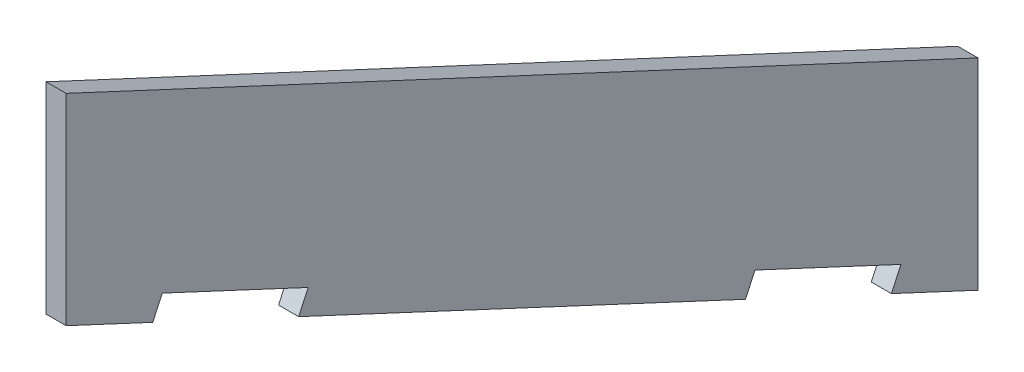
ISO-10303-21;
HEADER;
FILE_DESCRIPTION(('STEP AP214'),'2;1');
FILE_NAME('part.step','',(''),(''),'','','');
FILE_SCHEMA(('AUTOMOTIVE_DESIGN { 1 0 10303 214 1 1 1 1 }'));
ENDSEC;
DATA;
#1=APPLICATION_CONTEXT('core data for automotive mechanical design processes');
#2=APPLICATION_PROTOCOL_DEFINITION('international standard','automotive_design',2000,#1);
#3=PRODUCT_CONTEXT('',#1,'mechanical');
#4=PRODUCT('Part','Part','',(#3));
#5=PRODUCT_RELATED_PRODUCT_CATEGORY('part','',(#4));
#6=PRODUCT_DEFINITION_FORMATION('','',#4);
#7=PRODUCT_DEFINITION_CONTEXT('part definition',#1,'design');
#8=PRODUCT_DEFINITION('design','',#6,#7);
#9=PRODUCT_DEFINITION_SHAPE('','',#8);
#10=(LENGTH_UNIT() NAMED_UNIT(*) SI_UNIT(.MILLI.,.METRE.));
#11=(NAMED_UNIT(*) PLANE_ANGLE_UNIT() SI_UNIT($,.RADIAN.));
#12=(NAMED_UNIT(*) SI_UNIT($,.STERADIAN.) SOLID_ANGLE_UNIT());
#13=UNCERTAINTY_MEASURE_WITH_UNIT(LENGTH_MEASURE(1.E-05),#10,'distance_accuracy_value','');
#14=(GEOMETRIC_REPRESENTATION_CONTEXT(3) GLOBAL_UNCERTAINTY_ASSIGNED_CONTEXT((#13)) GLOBAL_UNIT_ASSIGNED_CONTEXT((#10,
#11,#12)) REPRESENTATION_CONTEXT('',''));
#15=CARTESIAN_POINT('',(0.,0.,0.));
#16=DIRECTION('',(0.,0.,1.));
#17=DIRECTION('',(1.,0.,0.));
#18=AXIS2_PLACEMENT_3D('',#15,#16,#17);
#19=CARTESIAN_POINT('',(34.,-2.,-10.));
#20=DIRECTION('',(0.,0.90630778703665,-0.4226182617407));
#21=DIRECTION('',(0.,-0.4226182617407,-0.906307787036649));
#22=AXIS2_PLACEMENT_3D('',#19,#20,#21);
#23=PLANE('',#22);
#24=DIRECTION('',(1.,0.,0.));
#25=VECTOR('',#24,1.);
#26=CARTESIAN_POINT('',(34.,-12.7767656743879,-33.1108485694346));
#27=LINE('',#26,#25);
#28=CARTESIAN_POINT('',(32.,-12.7767656743879,-33.1108485694346));
#29=VERTEX_POINT('',#28);
#30=CARTESIAN_POINT('',(34.,-12.7767656743879,-33.1108485694346));
#31=VERTEX_POINT('',#30);
#32=EDGE_CURVE('E11',#29,#31,#27,.T.);
#33=ORIENTED_EDGE('',*,*,#32,.F.);
#34=DIRECTION('',(0.,-0.4226182617407,-0.906307787036649));
#35=VECTOR('',#34,1.);
#36=CARTESIAN_POINT('',(32.,-2.,-10.));
#37=LINE('',#36,#35);
#38=CARTESIAN_POINT('',(32.,-33.4850604996822,-77.5199301342304));
#39=VERTEX_POINT('',#38);
#40=EDGE_CURVE('E116',#29,#39,#37,.T.);
#41=ORIENTED_EDGE('',*,*,#40,.T.);
#42=DIRECTION('',(1.,0.,0.));
#43=VECTOR('',#42,1.);
#44=CARTESIAN_POINT('',(34.,-33.4850604996822,-77.5199301342304));
#45=LINE('',#44,#43);
#46=CARTESIAN_POINT('',(34.,-33.4850604996822,-77.5199301342304));
#47=VERTEX_POINT('',#46);
#48=EDGE_CURVE('E47',#39,#47,#45,.T.);
#49=ORIENTED_EDGE('',*,*,#48,.T.);
#50=DIRECTION('',(0.,-0.4226182617407,-0.906307787036649));
#51=VECTOR('',#50,1.);
#52=CARTESIAN_POINT('',(34.,-2.,-10.));
#53=LINE('',#52,#51);
#54=EDGE_CURVE('E178',#31,#47,#53,.T.);
#55=ORIENTED_EDGE('',*,*,#54,.F.);
#56=EDGE_LOOP('',(#33,#41,#49,#55));
#57=FACE_BOUND('',#56,.T.);
#58=ADVANCED_FACE('F37',(#57),#23,.F.);
#59=CARTESIAN_POINT('',(34.,-33.7116374464413,-77.4142755687952));
#60=DIRECTION('',(0.,-0.422618261740708,-0.906307787036646));
#61=DIRECTION('',(0.,-0.906307787036646,0.422618261740708));
#62=AXIS2_PLACEMENT_3D('',#59,#60,#61);
#63=PLANE('',#62);
#64=ORIENTED_EDGE('',*,*,#48,.F.);
#65=DIRECTION('',(0.,-0.906307787036646,0.422618261740708));
#66=VECTOR('',#65,1.);
#67=CARTESIAN_POINT('',(32.,-33.7116374464413,-77.4142755687952));
#68=LINE('',#67,#66);
#69=CARTESIAN_POINT('',(32.,-31.4458679788497,-78.470821223147));
#70=VERTEX_POINT('',#69);
#71=EDGE_CURVE('E147',#70,#39,#68,.T.);
#72=ORIENTED_EDGE('',*,*,#71,.F.);
#73=DIRECTION('',(1.,0.,0.));
#74=VECTOR('',#73,1.);
#75=CARTESIAN_POINT('',(34.,-31.4458679788497,-78.470821223147));
#76=LINE('',#75,#74);
#77=CARTESIAN_POINT('',(34.,-31.4458679788497,-78.470821223147));
#78=VERTEX_POINT('',#77);
#79=EDGE_CURVE('E171',#70,#78,#76,.T.);
#80=ORIENTED_EDGE('',*,*,#79,.T.);
#81=DIRECTION('',(0.,-0.906307787036646,0.422618261740708));
#82=VECTOR('',#81,1.);
#83=CARTESIAN_POINT('',(34.,-33.7116374464413,-77.4142755687952));
#84=LINE('',#83,#82);
#85=EDGE_CURVE('E188',#78,#47,#84,.T.);
#86=ORIENTED_EDGE('',*,*,#85,.T.);
#87=EDGE_LOOP('',(#64,#72,#80,#86));
#88=FACE_BOUND('',#87,.T.);
#89=ADVANCED_FACE('F193',(#88),#63,.T.);
#90=CARTESIAN_POINT('',(34.,-31.4458679788497,-78.470821223147));
#91=DIRECTION('',(0.,-0.90630778703665,0.4226182617407));
#92=DIRECTION('',(0.,0.4226182617407,0.90630778703665));
#93=AXIS2_PLACEMENT_3D('',#90,#91,#92);
#94=PLANE('',#93);
#95=ORIENTED_EDGE('',*,*,#79,.F.);
#96=DIRECTION('',(0.,0.4226182617407,0.90630778703665));
#97=VECTOR('',#96,1.);
#98=CARTESIAN_POINT('',(32.,-31.4458679788497,-78.470821223147));
#99=LINE('',#98,#97);
#100=CARTESIAN_POINT('',(32.,-38.2077601667009,-92.9717458157334));
#101=VERTEX_POINT('',#100);
#102=EDGE_CURVE('E144',#101,#70,#99,.T.);
#103=ORIENTED_EDGE('',*,*,#102,.F.);
#104=DIRECTION('',(1.,0.,0.));
#105=VECTOR('',#104,1.);
#106=CARTESIAN_POINT('',(34.,-38.2077601667009,-92.9717458157334));
#107=LINE('',#106,#105);
#108=CARTESIAN_POINT('',(34.,-38.2077601667009,-92.9717458157334));
#109=VERTEX_POINT('',#108);
#110=EDGE_CURVE('E168',#101,#109,#107,.T.);
#111=ORIENTED_EDGE('',*,*,#110,.T.);
#112=DIRECTION('',(0.,0.4226182617407,0.90630778703665));
#113=VECTOR('',#112,1.);
#114=CARTESIAN_POINT('',(34.,-31.4458679788497,-78.470821223147));
#115=LINE('',#114,#113);
#116=EDGE_CURVE('E194',#109,#78,#115,.T.);
#117=ORIENTED_EDGE('',*,*,#116,.T.);
#118=EDGE_LOOP('',(#95,#103,#111,#117));
#119=FACE_BOUND('',#118,.T.);
#120=ADVANCED_FACE('F245',(#119),#94,.T.);
#121=CARTESIAN_POINT('',(34.,-38.2077601667009,-92.9717458157334));
#122=DIRECTION('',(0.,0.422618261740708,0.906307787036646));
#123=DIRECTION('',(0.,0.906307787036646,-0.422618261740708));
#124=AXIS2_PLACEMENT_3D('',#121,#122,#123);
#125=PLANE('',#124);
#126=ORIENTED_EDGE('',*,*,#110,.F.);
#127=DIRECTION('',(0.,0.906307787036646,-0.422618261740708));
#128=VECTOR('',#127,1.);
#129=CARTESIAN_POINT('',(32.,-38.2077601667009,-92.9717458157334));
#130=LINE('',#129,#128);
#131=CARTESIAN_POINT('',(32.,-40.2469526875334,-92.0208547268168));
#132=VERTEX_POINT('',#131);
#133=EDGE_CURVE('E141',#132,#101,#130,.T.);
#134=ORIENTED_EDGE('',*,*,#133,.F.);
#135=DIRECTION('',(1.,0.,0.));
#136=VECTOR('',#135,1.);
#137=CARTESIAN_POINT('',(34.,-40.2469526875334,-92.0208547268168));
#138=LINE('',#137,#136);
#139=CARTESIAN_POINT('',(34.,-40.2469526875334,-92.0208547268168));
#140=VERTEX_POINT('',#139);
#141=EDGE_CURVE('E165',#132,#140,#138,.T.);
#142=ORIENTED_EDGE('',*,*,#141,.T.);
#143=DIRECTION('',(0.,0.906307787036646,-0.422618261740708));
#144=VECTOR('',#143,1.);
#145=CARTESIAN_POINT('',(34.,-38.2077601667009,-92.9717458157334));
#146=LINE('',#145,#144);
#147=EDGE_CURVE('E196',#140,#109,#146,.T.);
#148=ORIENTED_EDGE('',*,*,#147,.T.);
#149=EDGE_LOOP('',(#126,#134,#142,#148));
#150=FACE_BOUND('',#149,.T.);
#151=ADVANCED_FACE('F248',(#150),#125,.T.);
#152=ORIENTED_EDGE('',*,*,#141,.F.);
#153=DIRECTION('',(0.,-0.4226182617407,-0.906307787036649));
#154=VECTOR('',#153,1.);
#155=CARTESIAN_POINT('',(32.,-2.,-10.));
#156=LINE('',#155,#154);
#157=CARTESIAN_POINT('',(32.,-44.26182617407,-100.630778703665));
#158=VERTEX_POINT('',#157);
#159=EDGE_CURVE('E138',#132,#158,#156,.T.);
#160=ORIENTED_EDGE('',*,*,#159,.T.);
#161=DIRECTION('',(1.,0.,0.));
#162=VECTOR('',#161,1.);
#163=CARTESIAN_POINT('',(34.,-44.26182617407,-100.630778703665));
#164=LINE('',#163,#162);
#165=CARTESIAN_POINT('',(34.,-44.26182617407,-100.630778703665));
#166=VERTEX_POINT('',#165);
#167=EDGE_CURVE('E162',#158,#166,#164,.T.);
#168=ORIENTED_EDGE('',*,*,#167,.T.);
#169=EDGE_CURVE('E192',#140,#166,#53,.T.);
#170=ORIENTED_EDGE('',*,*,#169,.F.);
#171=EDGE_LOOP('',(#152,#160,#168,#170));
#172=FACE_BOUND('',#171,.T.);
#173=ADVANCED_FACE('F249',(#172),#23,.F.);
#174=CARTESIAN_POINT('',(34.,0.,-100.630778703665));
#175=DIRECTION('',(0.,0.,1.));
#176=DIRECTION('',(0.,1.,0.));
#177=AXIS2_PLACEMENT_3D('',#174,#175,#176);
#178=PLANE('',#177);
#179=ORIENTED_EDGE('',*,*,#167,.F.);
#180=DIRECTION('',(0.,1.,0.));
#181=VECTOR('',#180,1.);
#182=CARTESIAN_POINT('',(32.,0.,-100.630778703665));
#183=LINE('',#182,#181);
#184=CARTESIAN_POINT('',(32.,-24.26182617407,-100.630778703665));
#185=VERTEX_POINT('',#184);
#186=EDGE_CURVE('E135',#158,#185,#183,.T.);
#187=ORIENTED_EDGE('',*,*,#186,.T.);
#188=DIRECTION('',(1.,0.,0.));
#189=VECTOR('',#188,1.);
#190=CARTESIAN_POINT('',(34.,-24.26182617407,-100.630778703665));
#191=LINE('',#190,#189);
#192=CARTESIAN_POINT('',(34.,-24.26182617407,-100.630778703665));
#193=VERTEX_POINT('',#192);
#194=EDGE_CURVE('E159',#185,#193,#191,.T.);
#195=ORIENTED_EDGE('',*,*,#194,.T.);
#196=DIRECTION('',(0.,1.,0.));
#197=VECTOR('',#196,1.);
#198=CARTESIAN_POINT('',(34.,0.,-100.630778703665));
#199=LINE('',#198,#197);
#200=EDGE_CURVE('E202',#166,#193,#199,.T.);
#201=ORIENTED_EDGE('',*,*,#200,.F.);
#202=EDGE_LOOP('',(#179,#187,#195,#201));
#203=FACE_BOUND('',#202,.T.);
#204=ADVANCED_FACE('F224',(#203),#178,.F.);
#205=CARTESIAN_POINT('',(34.,18.,-9.99999999999997));
#206=DIRECTION('',(0.,-0.90630778703665,0.4226182617407));
#207=DIRECTION('',(0.,0.4226182617407,0.90630778703665));
#208=AXIS2_PLACEMENT_3D('',#205,#206,#207);
#209=PLANE('',#208);
#210=ORIENTED_EDGE('',*,*,#194,.F.);
#211=DIRECTION('',(0.,0.4226182617407,0.90630778703665));
#212=VECTOR('',#211,1.);
#213=CARTESIAN_POINT('',(32.,18.,-9.99999999999997));
#214=LINE('',#213,#212);
#215=CARTESIAN_POINT('',(32.,18.,-9.99999999999997));
#216=VERTEX_POINT('',#215);
#217=EDGE_CURVE('E132',#185,#216,#214,.T.);
#218=ORIENTED_EDGE('',*,*,#217,.T.);
#219=DIRECTION('',(1.,0.,0.));
#220=VECTOR('',#219,1.);
#221=CARTESIAN_POINT('',(34.,18.,-9.99999999999997));
#222=LINE('',#221,#220);
#223=CARTESIAN_POINT('',(34.,18.,-9.99999999999997));
#224=VERTEX_POINT('',#223);
#225=EDGE_CURVE('E156',#216,#224,#222,.T.);
#226=ORIENTED_EDGE('',*,*,#225,.T.);
#227=DIRECTION('',(0.,0.4226182617407,0.90630778703665));
#228=VECTOR('',#227,1.);
#229=CARTESIAN_POINT('',(34.,18.,-9.99999999999997));
#230=LINE('',#229,#228);
#231=EDGE_CURVE('E205',#193,#224,#230,.T.);
#232=ORIENTED_EDGE('',*,*,#231,.F.);
#233=EDGE_LOOP('',(#210,#218,#226,#232));
#234=FACE_BOUND('',#233,.T.);
#235=ADVANCED_FACE('F230',(#234),#209,.F.);
#236=CARTESIAN_POINT('',(34.,0.,-9.99999999999997));
#237=DIRECTION('',(0.,0.,1.));
#238=DIRECTION('',(0.,1.,0.));
#239=AXIS2_PLACEMENT_3D('',#236,#237,#238);
#240=PLANE('',#239);
#241=ORIENTED_EDGE('',*,*,#225,.F.);
#242=DIRECTION('',(0.,1.,0.));
#243=VECTOR('',#242,1.);
#244=CARTESIAN_POINT('',(32.,0.,-9.99999999999997));
#245=LINE('',#244,#243);
#246=CARTESIAN_POINT('',(32.,-2.,-10.));
#247=VERTEX_POINT('',#246);
#248=EDGE_CURVE('E129',#216,#247,#245,.F.);
#249=ORIENTED_EDGE('',*,*,#248,.T.);
#250=DIRECTION('',(1.,0.,0.));
#251=VECTOR('',#250,1.);
#252=CARTESIAN_POINT('',(34.,-2.,-10.));
#253=LINE('',#252,#251);
#254=CARTESIAN_POINT('',(34.,-2.,-10.));
#255=VERTEX_POINT('',#254);
#256=EDGE_CURVE('E153',#247,#255,#253,.T.);
#257=ORIENTED_EDGE('',*,*,#256,.T.);
#258=DIRECTION('',(0.,1.,0.));
#259=VECTOR('',#258,1.);
#260=CARTESIAN_POINT('',(34.,0.,-9.99999999999997));
#261=LINE('',#260,#259);
#262=EDGE_CURVE('E207',#224,#255,#261,.F.);
#263=ORIENTED_EDGE('',*,*,#262,.F.);
#264=EDGE_LOOP('',(#241,#249,#257,#263));
#265=FACE_BOUND('',#264,.T.);
#266=ADVANCED_FACE('F235',(#265),#240,.T.);
#267=ORIENTED_EDGE('',*,*,#256,.F.);
#268=DIRECTION('',(0.,-0.4226182617407,-0.906307787036649));
#269=VECTOR('',#268,1.);
#270=CARTESIAN_POINT('',(32.,-2.,-10.));
#271=LINE('',#270,#269);
#272=CARTESIAN_POINT('',(32.,-6.01487348653665,-18.6099239768482));
#273=VERTEX_POINT('',#272);
#274=EDGE_CURVE('E126',#247,#273,#271,.T.);
#275=ORIENTED_EDGE('',*,*,#274,.T.);
#276=DIRECTION('',(1.,0.,0.));
#277=VECTOR('',#276,1.);
#278=CARTESIAN_POINT('',(34.,-6.01487348653665,-18.6099239768482));
#279=LINE('',#278,#277);
#280=CARTESIAN_POINT('',(34.,-6.01487348653665,-18.6099239768482));
#281=VERTEX_POINT('',#280);
#282=EDGE_CURVE('E151',#273,#281,#279,.T.);
#283=ORIENTED_EDGE('',*,*,#282,.T.);
#284=EDGE_CURVE('E191',#255,#281,#53,.T.);
#285=ORIENTED_EDGE('',*,*,#284,.F.);
#286=EDGE_LOOP('',(#267,#275,#283,#285));
#287=FACE_BOUND('',#286,.T.);
#288=ADVANCED_FACE('F252',(#287),#23,.F.);
#289=CARTESIAN_POINT('',(34.,-6.2414504332958,-18.504269411413));
#290=DIRECTION('',(0.,-0.422618261740708,-0.906307787036646));
#291=DIRECTION('',(0.,-0.906307787036646,0.422618261740708));
#292=AXIS2_PLACEMENT_3D('',#289,#290,#291);
#293=PLANE('',#292);
#294=ORIENTED_EDGE('',*,*,#282,.F.);
#295=DIRECTION('',(0.,-0.906307787036646,0.422618261740708));
#296=VECTOR('',#295,1.);
#297=CARTESIAN_POINT('',(32.,-6.2414504332958,-18.504269411413));
#298=LINE('',#297,#296);
#299=CARTESIAN_POINT('',(32.,-3.97568096570419,-19.5608150657648));
#300=VERTEX_POINT('',#299);
#301=EDGE_CURVE('E123',#300,#273,#298,.T.);
#302=ORIENTED_EDGE('',*,*,#301,.F.);
#303=DIRECTION('',(1.,0.,0.));
#304=VECTOR('',#303,1.);
#305=CARTESIAN_POINT('',(34.,-3.97568096570419,-19.5608150657648));
#306=LINE('',#305,#304);
#307=CARTESIAN_POINT('',(34.,-3.97568096570419,-19.5608150657648));
#308=VERTEX_POINT('',#307);
#309=EDGE_CURVE('E55',#300,#308,#306,.T.);
#310=ORIENTED_EDGE('',*,*,#309,.T.);
#311=DIRECTION('',(0.,-0.906307787036646,0.422618261740708));
#312=VECTOR('',#311,1.);
#313=CARTESIAN_POINT('',(34.,-6.2414504332958,-18.504269411413));
#314=LINE('',#313,#312);
#315=EDGE_CURVE('E109',#308,#281,#314,.T.);
#316=ORIENTED_EDGE('',*,*,#315,.T.);
#317=EDGE_LOOP('',(#294,#302,#310,#316));
#318=FACE_BOUND('',#317,.T.);
#319=ADVANCED_FACE('F262',(#318),#293,.T.);
#320=CARTESIAN_POINT('',(34.,-3.97568096570419,-19.5608150657648));
#321=DIRECTION('',(0.,-0.90630778703665,0.4226182617407));
#322=DIRECTION('',(0.,0.4226182617407,0.90630778703665));
#323=AXIS2_PLACEMENT_3D('',#320,#321,#322);
#324=PLANE('',#323);
#325=ORIENTED_EDGE('',*,*,#309,.F.);
#326=DIRECTION('',(0.,0.4226182617407,0.90630778703665));
#327=VECTOR('',#326,1.);
#328=CARTESIAN_POINT('',(32.,-3.97568096570419,-19.5608150657648));
#329=LINE('',#328,#327);
#330=CARTESIAN_POINT('',(32.,-10.7375731535554,-34.0617396583512));
#331=VERTEX_POINT('',#330);
#332=EDGE_CURVE('E114',#331,#300,#329,.T.);
#333=ORIENTED_EDGE('',*,*,#332,.F.);
#334=DIRECTION('',(1.,0.,0.));
#335=VECTOR('',#334,1.);
#336=CARTESIAN_POINT('',(34.,-10.7375731535554,-34.0617396583512));
#337=LINE('',#336,#335);
#338=CARTESIAN_POINT('',(34.,-10.7375731535554,-34.0617396583512));
#339=VERTEX_POINT('',#338);
#340=EDGE_CURVE('E41',#331,#339,#337,.T.);
#341=ORIENTED_EDGE('',*,*,#340,.T.);
#342=DIRECTION('',(0.,0.4226182617407,0.90630778703665));
#343=VECTOR('',#342,1.);
#344=CARTESIAN_POINT('',(34.,-3.97568096570419,-19.5608150657648));
#345=LINE('',#344,#343);
#346=EDGE_CURVE('E125',#339,#308,#345,.T.);
#347=ORIENTED_EDGE('',*,*,#346,.T.);
#348=EDGE_LOOP('',(#325,#333,#341,#347));
#349=FACE_BOUND('',#348,.T.);
#350=ADVANCED_FACE('F118',(#349),#324,.T.);
#351=CARTESIAN_POINT('',(34.,-10.7375731535554,-34.0617396583512));
#352=DIRECTION('',(0.,0.422618261740708,0.906307787036646));
#353=DIRECTION('',(0.,0.906307787036646,-0.422618261740708));
#354=AXIS2_PLACEMENT_3D('',#351,#352,#353);
#355=PLANE('',#354);
#356=DIRECTION('',(0.,0.906307787036646,-0.422618261740708));
#357=VECTOR('',#356,1.);
#358=CARTESIAN_POINT('',(32.,-10.7375731535554,-34.0617396583512));
#359=LINE('',#358,#357);
#360=EDGE_CURVE('E103',#29,#331,#359,.T.);
#361=ORIENTED_EDGE('',*,*,#360,.F.);
#362=ORIENTED_EDGE('',*,*,#32,.T.);
#363=DIRECTION('',(0.,0.906307787036646,-0.422618261740708));
#364=VECTOR('',#363,1.);
#365=CARTESIAN_POINT('',(34.,-10.7375731535554,-34.0617396583512));
#366=LINE('',#365,#364);
#367=EDGE_CURVE('E105',#31,#339,#366,.T.);
#368=ORIENTED_EDGE('',*,*,#367,.T.);
#369=ORIENTED_EDGE('',*,*,#340,.F.);
#370=EDGE_LOOP('',(#361,#362,#368,#369));
#371=FACE_BOUND('',#370,.T.);
#372=ADVANCED_FACE('F39',(#371),#355,.T.);
#373=CARTESIAN_POINT('',(34.,0.,0.));
#374=DIRECTION('',(-1.,0.,0.));
#375=DIRECTION('',(0.,0.,1.));
#376=AXIS2_PLACEMENT_3D('',#373,#374,#375);
#377=PLANE('',#376);
#378=ORIENTED_EDGE('',*,*,#346,.F.);
#379=ORIENTED_EDGE('',*,*,#367,.F.);
#380=ORIENTED_EDGE('',*,*,#54,.T.);
#381=ORIENTED_EDGE('',*,*,#85,.F.);
#382=ORIENTED_EDGE('',*,*,#116,.F.);
#383=ORIENTED_EDGE('',*,*,#147,.F.);
#384=ORIENTED_EDGE('',*,*,#169,.T.);
#385=ORIENTED_EDGE('',*,*,#200,.T.);
#386=ORIENTED_EDGE('',*,*,#231,.T.);
#387=ORIENTED_EDGE('',*,*,#262,.T.);
#388=ORIENTED_EDGE('',*,*,#284,.T.);
#389=ORIENTED_EDGE('',*,*,#315,.F.);
#390=EDGE_LOOP('',(#378,#379,#380,#381,#382,#383,#384,#385,#386,#387,#388,#389));
#391=FACE_BOUND('',#390,.T.);
#392=ADVANCED_FACE('F186',(#391),#377,.F.);
#393=CARTESIAN_POINT('',(32.,0.,0.));
#394=DIRECTION('',(-1.,0.,0.));
#395=DIRECTION('',(0.,0.,1.));
#396=AXIS2_PLACEMENT_3D('',#393,#394,#395);
#397=PLANE('',#396);
#398=ORIENTED_EDGE('',*,*,#332,.T.);
#399=ORIENTED_EDGE('',*,*,#301,.T.);
#400=ORIENTED_EDGE('',*,*,#274,.F.);
#401=ORIENTED_EDGE('',*,*,#248,.F.);
#402=ORIENTED_EDGE('',*,*,#217,.F.);
#403=ORIENTED_EDGE('',*,*,#186,.F.);
#404=ORIENTED_EDGE('',*,*,#159,.F.);
#405=ORIENTED_EDGE('',*,*,#133,.T.);
#406=ORIENTED_EDGE('',*,*,#102,.T.);
#407=ORIENTED_EDGE('',*,*,#71,.T.);
#408=ORIENTED_EDGE('',*,*,#40,.F.);
#409=ORIENTED_EDGE('',*,*,#360,.T.);
#410=EDGE_LOOP('',(#398,#399,#400,#401,#402,#403,#404,#405,#406,#407,#408,#409));
#411=FACE_BOUND('',#410,.T.);
#412=ADVANCED_FACE('F112',(#411),#397,.T.);
#413=CLOSED_SHELL('',(#58,#89,#120,#151,#173,#204,#235,#266,#288,#319,#350,#372,#392,#412));
#414=MANIFOLD_SOLID_BREP('B2',#413);
#415=ADVANCED_BREP_SHAPE_REPRESENTATION('',(#18,#414),#14);
#416=SHAPE_DEFINITION_REPRESENTATION(#9,#415);
ENDSEC;
END-ISO-10303-21;
